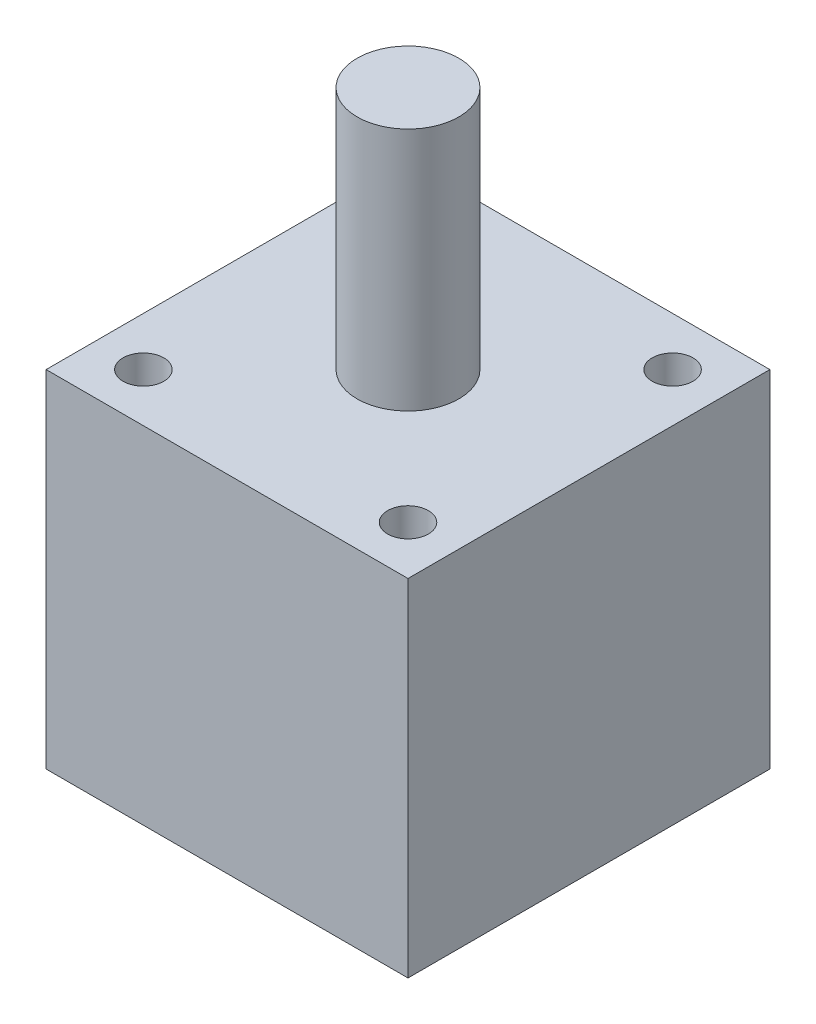
ISO-10303-21;
HEADER;
FILE_DESCRIPTION(('STEP AP214'),'2;1');
FILE_NAME('part.step','',(''),(''),'','','');
FILE_SCHEMA(('AUTOMOTIVE_DESIGN { 1 0 10303 214 1 1 1 1 }'));
ENDSEC;
DATA;
#1=APPLICATION_CONTEXT('core data for automotive mechanical design processes');
#2=APPLICATION_PROTOCOL_DEFINITION('international standard','automotive_design',2000,#1);
#3=PRODUCT_CONTEXT('',#1,'mechanical');
#4=PRODUCT('Part','Part','',(#3));
#5=PRODUCT_RELATED_PRODUCT_CATEGORY('part','',(#4));
#6=PRODUCT_DEFINITION_FORMATION('','',#4);
#7=PRODUCT_DEFINITION_CONTEXT('part definition',#1,'design');
#8=PRODUCT_DEFINITION('design','',#6,#7);
#9=PRODUCT_DEFINITION_SHAPE('','',#8);
#10=(LENGTH_UNIT() NAMED_UNIT(*) SI_UNIT(.MILLI.,.METRE.));
#11=(NAMED_UNIT(*) PLANE_ANGLE_UNIT() SI_UNIT($,.RADIAN.));
#12=(NAMED_UNIT(*) SI_UNIT($,.STERADIAN.) SOLID_ANGLE_UNIT());
#13=UNCERTAINTY_MEASURE_WITH_UNIT(LENGTH_MEASURE(1.E-05),#10,'distance_accuracy_value','');
#14=(GEOMETRIC_REPRESENTATION_CONTEXT(3) GLOBAL_UNCERTAINTY_ASSIGNED_CONTEXT((#13)) GLOBAL_UNIT_ASSIGNED_CONTEXT((#10,
#11,#12)) REPRESENTATION_CONTEXT('',''));
#15=CARTESIAN_POINT('',(0.,0.,0.));
#16=DIRECTION('',(0.,0.,1.));
#17=DIRECTION('',(1.,0.,0.));
#18=AXIS2_PLACEMENT_3D('',#15,#16,#17);
#19=CARTESIAN_POINT('',(17.78,34.,17.78));
#20=DIRECTION('',(-1.,0.,0.));
#21=DIRECTION('',(0.,0.,1.));
#22=AXIS2_PLACEMENT_3D('',#19,#20,#21);
#23=PLANE('',#22);
#24=DIRECTION('',(0.,0.,-1.));
#25=VECTOR('',#24,1.);
#26=CARTESIAN_POINT('',(17.78,0.,17.78));
#27=LINE('',#26,#25);
#28=CARTESIAN_POINT('',(17.78,0.,17.78));
#29=VERTEX_POINT('',#28);
#30=CARTESIAN_POINT('',(17.78,0.,-17.78));
#31=VERTEX_POINT('',#30);
#32=EDGE_CURVE('E113',#29,#31,#27,.T.);
#33=ORIENTED_EDGE('',*,*,#32,.T.);
#34=DIRECTION('',(0.,-1.,0.));
#35=VECTOR('',#34,1.);
#36=CARTESIAN_POINT('',(17.78,34.,-17.78));
#37=LINE('',#36,#35);
#38=CARTESIAN_POINT('',(17.78,34.,-17.78));
#39=VERTEX_POINT('',#38);
#40=EDGE_CURVE('E44',#39,#31,#37,.T.);
#41=ORIENTED_EDGE('',*,*,#40,.F.);
#42=DIRECTION('',(0.,0.,-1.));
#43=VECTOR('',#42,1.);
#44=CARTESIAN_POINT('',(17.78,34.,17.78));
#45=LINE('',#44,#43);
#46=CARTESIAN_POINT('',(17.78,34.,17.78));
#47=VERTEX_POINT('',#46);
#48=EDGE_CURVE('E96',#47,#39,#45,.T.);
#49=ORIENTED_EDGE('',*,*,#48,.F.);
#50=DIRECTION('',(0.,-1.,0.));
#51=VECTOR('',#50,1.);
#52=CARTESIAN_POINT('',(17.78,34.,17.78));
#53=LINE('',#52,#51);
#54=EDGE_CURVE('E109',#47,#29,#53,.T.);
#55=ORIENTED_EDGE('',*,*,#54,.T.);
#56=EDGE_LOOP('',(#33,#41,#49,#55));
#57=FACE_BOUND('',#56,.T.);
#58=ADVANCED_FACE('F41',(#57),#23,.F.);
#59=CARTESIAN_POINT('',(-17.78,34.,-17.78));
#60=DIRECTION('',(0.,0.,1.));
#61=DIRECTION('',(1.,0.,0.));
#62=AXIS2_PLACEMENT_3D('',#59,#60,#61);
#63=PLANE('',#62);
#64=DIRECTION('',(-1.,0.,0.));
#65=VECTOR('',#64,1.);
#66=CARTESIAN_POINT('',(-17.78,0.,-17.78));
#67=LINE('',#66,#65);
#68=CARTESIAN_POINT('',(-17.78,0.,-17.78));
#69=VERTEX_POINT('',#68);
#70=EDGE_CURVE('E102',#31,#69,#67,.T.);
#71=ORIENTED_EDGE('',*,*,#70,.T.);
#72=DIRECTION('',(0.,-1.,0.));
#73=VECTOR('',#72,1.);
#74=CARTESIAN_POINT('',(-17.78,34.,-17.78));
#75=LINE('',#74,#73);
#76=CARTESIAN_POINT('',(-17.78,34.,-17.78));
#77=VERTEX_POINT('',#76);
#78=EDGE_CURVE('E100',#77,#69,#75,.T.);
#79=ORIENTED_EDGE('',*,*,#78,.F.);
#80=DIRECTION('',(-1.,0.,0.));
#81=VECTOR('',#80,1.);
#82=CARTESIAN_POINT('',(-17.78,34.,-17.78));
#83=LINE('',#82,#81);
#84=EDGE_CURVE('E91',#39,#77,#83,.T.);
#85=ORIENTED_EDGE('',*,*,#84,.F.);
#86=ORIENTED_EDGE('',*,*,#40,.T.);
#87=EDGE_LOOP('',(#71,#79,#85,#86));
#88=FACE_BOUND('',#87,.T.);
#89=ADVANCED_FACE('F101',(#88),#63,.F.);
#90=CARTESIAN_POINT('',(-17.78,34.,17.78));
#91=DIRECTION('',(1.,0.,0.));
#92=DIRECTION('',(0.,0.,-1.));
#93=AXIS2_PLACEMENT_3D('',#90,#91,#92);
#94=PLANE('',#93);
#95=DIRECTION('',(0.,0.,1.));
#96=VECTOR('',#95,1.);
#97=CARTESIAN_POINT('',(-17.78,0.,17.78));
#98=LINE('',#97,#96);
#99=CARTESIAN_POINT('',(-17.78,0.,17.78));
#100=VERTEX_POINT('',#99);
#101=EDGE_CURVE('E77',#69,#100,#98,.T.);
#102=ORIENTED_EDGE('',*,*,#101,.T.);
#103=DIRECTION('',(0.,-1.,0.));
#104=VECTOR('',#103,1.);
#105=CARTESIAN_POINT('',(-17.78,34.,17.78));
#106=LINE('',#105,#104);
#107=CARTESIAN_POINT('',(-17.78,34.,17.78));
#108=VERTEX_POINT('',#107);
#109=EDGE_CURVE('E104',#108,#100,#106,.T.);
#110=ORIENTED_EDGE('',*,*,#109,.F.);
#111=DIRECTION('',(0.,0.,1.));
#112=VECTOR('',#111,1.);
#113=CARTESIAN_POINT('',(-17.78,34.,17.78));
#114=LINE('',#113,#112);
#115=EDGE_CURVE('E94',#77,#108,#114,.T.);
#116=ORIENTED_EDGE('',*,*,#115,.F.);
#117=ORIENTED_EDGE('',*,*,#78,.T.);
#118=EDGE_LOOP('',(#102,#110,#116,#117));
#119=FACE_BOUND('',#118,.T.);
#120=ADVANCED_FACE('F105',(#119),#94,.F.);
#121=CARTESIAN_POINT('',(-17.78,34.,17.78));
#122=DIRECTION('',(0.,0.,-1.));
#123=DIRECTION('',(-1.,0.,0.));
#124=AXIS2_PLACEMENT_3D('',#121,#122,#123);
#125=PLANE('',#124);
#126=DIRECTION('',(1.,0.,0.));
#127=VECTOR('',#126,1.);
#128=CARTESIAN_POINT('',(-17.78,0.,17.78));
#129=LINE('',#128,#127);
#130=EDGE_CURVE('E83',#100,#29,#129,.T.);
#131=ORIENTED_EDGE('',*,*,#130,.T.);
#132=ORIENTED_EDGE('',*,*,#54,.F.);
#133=DIRECTION('',(1.,0.,0.));
#134=VECTOR('',#133,1.);
#135=CARTESIAN_POINT('',(-17.78,34.,17.78));
#136=LINE('',#135,#134);
#137=EDGE_CURVE('E60',#108,#47,#136,.T.);
#138=ORIENTED_EDGE('',*,*,#137,.F.);
#139=ORIENTED_EDGE('',*,*,#109,.T.);
#140=EDGE_LOOP('',(#131,#132,#138,#139));
#141=FACE_BOUND('',#140,.T.);
#142=ADVANCED_FACE('F127',(#141),#125,.F.);
#143=CARTESIAN_POINT('',(0.,34.,0.));
#144=DIRECTION('',(0.,-1.,0.));
#145=DIRECTION('',(0.,0.,-1.));
#146=AXIS2_PLACEMENT_3D('',#143,#144,#145);
#147=PLANE('',#146);
#148=CARTESIAN_POINT('',(-13.,34.,13.));
#149=DIRECTION('',(0.,1.,0.));
#150=DIRECTION('',(0.,0.,1.));
#151=AXIS2_PLACEMENT_3D('',#148,#149,#150);
#152=CIRCLE('',#151,2.);
#153=CARTESIAN_POINT('',(-13.,34.,15.));
#154=VERTEX_POINT('',#153);
#155=EDGE_CURVE('E158',#154,#154,#152,.T.);
#156=ORIENTED_EDGE('',*,*,#155,.F.);
#157=EDGE_LOOP('',(#156));
#158=FACE_BOUND('',#157,.T.);
#159=CARTESIAN_POINT('',(13.,34.,13.));
#160=DIRECTION('',(0.,1.,0.));
#161=DIRECTION('',(0.,0.,1.));
#162=AXIS2_PLACEMENT_3D('',#159,#160,#161);
#163=CIRCLE('',#162,2.);
#164=CARTESIAN_POINT('',(13.,34.,15.));
#165=VERTEX_POINT('',#164);
#166=EDGE_CURVE('E157',#165,#165,#163,.T.);
#167=ORIENTED_EDGE('',*,*,#166,.F.);
#168=EDGE_LOOP('',(#167));
#169=FACE_BOUND('',#168,.T.);
#170=CARTESIAN_POINT('',(13.,34.,-13.));
#171=DIRECTION('',(0.,1.,0.));
#172=DIRECTION('',(0.,0.,1.));
#173=AXIS2_PLACEMENT_3D('',#170,#171,#172);
#174=CIRCLE('',#173,2.);
#175=CARTESIAN_POINT('',(13.,34.,-11.));
#176=VERTEX_POINT('',#175);
#177=EDGE_CURVE('E166',#176,#176,#174,.T.);
#178=ORIENTED_EDGE('',*,*,#177,.F.);
#179=EDGE_LOOP('',(#178));
#180=FACE_BOUND('',#179,.T.);
#181=CARTESIAN_POINT('',(-13.,34.,-13.));
#182=DIRECTION('',(0.,1.,0.));
#183=DIRECTION('',(0.,0.,1.));
#184=AXIS2_PLACEMENT_3D('',#181,#182,#183);
#185=CIRCLE('',#184,2.);
#186=CARTESIAN_POINT('',(-13.,34.,-11.));
#187=VERTEX_POINT('',#186);
#188=EDGE_CURVE('E148',#187,#187,#185,.T.);
#189=ORIENTED_EDGE('',*,*,#188,.F.);
#190=EDGE_LOOP('',(#189));
#191=FACE_BOUND('',#190,.T.);
#192=CARTESIAN_POINT('',(0.,34.,0.));
#193=DIRECTION('',(0.,1.,0.));
#194=DIRECTION('',(0.,0.,1.));
#195=AXIS2_PLACEMENT_3D('',#192,#193,#194);
#196=CIRCLE('',#195,5.);
#197=CARTESIAN_POINT('',(0.,34.,5.));
#198=VERTEX_POINT('',#197);
#199=EDGE_CURVE('E51',#198,#198,#196,.T.);
#200=ORIENTED_EDGE('',*,*,#199,.F.);
#201=EDGE_LOOP('',(#200));
#202=FACE_BOUND('',#201,.T.);
#203=ORIENTED_EDGE('',*,*,#48,.T.);
#204=ORIENTED_EDGE('',*,*,#84,.T.);
#205=ORIENTED_EDGE('',*,*,#115,.T.);
#206=ORIENTED_EDGE('',*,*,#137,.T.);
#207=EDGE_LOOP('',(#203,#204,#205,#206));
#208=FACE_BOUND('',#207,.T.);
#209=ADVANCED_FACE('F92',(#158,#169,#180,#191,#202,#208),#147,.F.);
#210=CARTESIAN_POINT('',(0.,0.,0.));
#211=DIRECTION('',(0.,-1.,0.));
#212=DIRECTION('',(0.,0.,-1.));
#213=AXIS2_PLACEMENT_3D('',#210,#211,#212);
#214=PLANE('',#213);
#215=CARTESIAN_POINT('',(-13.,0.,13.));
#216=DIRECTION('',(0.,-1.,0.));
#217=DIRECTION('',(0.,0.,-1.));
#218=AXIS2_PLACEMENT_3D('',#215,#216,#217);
#219=CIRCLE('',#218,2.);
#220=CARTESIAN_POINT('',(-13.,0.,11.));
#221=VERTEX_POINT('',#220);
#222=EDGE_CURVE('E153',#221,#221,#219,.F.);
#223=ORIENTED_EDGE('',*,*,#222,.T.);
#224=EDGE_LOOP('',(#223));
#225=FACE_BOUND('',#224,.T.);
#226=CARTESIAN_POINT('',(13.,0.,13.));
#227=DIRECTION('',(0.,-1.,0.));
#228=DIRECTION('',(0.,0.,-1.));
#229=AXIS2_PLACEMENT_3D('',#226,#227,#228);
#230=CIRCLE('',#229,2.);
#231=CARTESIAN_POINT('',(13.,0.,11.));
#232=VERTEX_POINT('',#231);
#233=EDGE_CURVE('E162',#232,#232,#230,.F.);
#234=ORIENTED_EDGE('',*,*,#233,.T.);
#235=EDGE_LOOP('',(#234));
#236=FACE_BOUND('',#235,.T.);
#237=CARTESIAN_POINT('',(13.,0.,-13.));
#238=DIRECTION('',(0.,-1.,0.));
#239=DIRECTION('',(0.,0.,-1.));
#240=AXIS2_PLACEMENT_3D('',#237,#238,#239);
#241=CIRCLE('',#240,2.);
#242=CARTESIAN_POINT('',(13.,0.,-15.));
#243=VERTEX_POINT('',#242);
#244=EDGE_CURVE('E152',#243,#243,#241,.F.);
#245=ORIENTED_EDGE('',*,*,#244,.T.);
#246=EDGE_LOOP('',(#245));
#247=FACE_BOUND('',#246,.T.);
#248=CARTESIAN_POINT('',(-13.,0.,-13.));
#249=DIRECTION('',(0.,-1.,0.));
#250=DIRECTION('',(0.,0.,-1.));
#251=AXIS2_PLACEMENT_3D('',#248,#249,#250);
#252=CIRCLE('',#251,2.);
#253=CARTESIAN_POINT('',(-13.,0.,-15.));
#254=VERTEX_POINT('',#253);
#255=EDGE_CURVE('E144',#254,#254,#252,.F.);
#256=ORIENTED_EDGE('',*,*,#255,.T.);
#257=EDGE_LOOP('',(#256));
#258=FACE_BOUND('',#257,.T.);
#259=CARTESIAN_POINT('',(0.,0.,0.));
#260=DIRECTION('',(0.,-1.,0.));
#261=DIRECTION('',(0.,0.,-1.));
#262=AXIS2_PLACEMENT_3D('',#259,#260,#261);
#263=CIRCLE('',#262,5.);
#264=CARTESIAN_POINT('',(0.,0.,-5.));
#265=VERTEX_POINT('',#264);
#266=EDGE_CURVE('E11',#265,#265,#263,.T.);
#267=ORIENTED_EDGE('',*,*,#266,.F.);
#268=EDGE_LOOP('',(#267));
#269=FACE_BOUND('',#268,.T.);
#270=ORIENTED_EDGE('',*,*,#32,.F.);
#271=ORIENTED_EDGE('',*,*,#130,.F.);
#272=ORIENTED_EDGE('',*,*,#101,.F.);
#273=ORIENTED_EDGE('',*,*,#70,.F.);
#274=EDGE_LOOP('',(#270,#271,#272,#273));
#275=FACE_BOUND('',#274,.T.);
#276=ADVANCED_FACE('F130',(#225,#236,#247,#258,#269,#275),#214,.T.);
#277=CARTESIAN_POINT('',(0.,58.,0.));
#278=DIRECTION('',(0.,-1.,0.));
#279=DIRECTION('',(0.,0.,-1.));
#280=AXIS2_PLACEMENT_3D('',#277,#278,#279);
#281=CYLINDRICAL_SURFACE('',#280,5.);
#282=CARTESIAN_POINT('',(0.,58.,0.));
#283=DIRECTION('',(0.,1.,0.));
#284=DIRECTION('',(0.,0.,1.));
#285=AXIS2_PLACEMENT_3D('',#282,#283,#284);
#286=CIRCLE('',#285,5.);
#287=CARTESIAN_POINT('',(0.,58.,5.));
#288=VERTEX_POINT('',#287);
#289=EDGE_CURVE('E117',#288,#288,#286,.T.);
#290=ORIENTED_EDGE('',*,*,#289,.F.);
#291=EDGE_LOOP('',(#290));
#292=FACE_BOUND('',#291,.T.);
#293=ORIENTED_EDGE('',*,*,#199,.T.);
#294=EDGE_LOOP('',(#293));
#295=FACE_BOUND('',#294,.T.);
#296=ADVANCED_FACE('F188',(#292,#295),#281,.T.);
#297=CARTESIAN_POINT('',(0.,58.,0.));
#298=DIRECTION('',(0.,1.,0.));
#299=DIRECTION('',(0.,0.,1.));
#300=AXIS2_PLACEMENT_3D('',#297,#298,#299);
#301=PLANE('',#300);
#302=ORIENTED_EDGE('',*,*,#289,.T.);
#303=EDGE_LOOP('',(#302));
#304=FACE_BOUND('',#303,.T.);
#305=ADVANCED_FACE('F190',(#304),#301,.T.);
#306=CARTESIAN_POINT('',(0.,-12.,0.));
#307=DIRECTION('',(0.,1.,0.));
#308=DIRECTION('',(0.,0.,1.));
#309=AXIS2_PLACEMENT_3D('',#306,#307,#308);
#310=CYLINDRICAL_SURFACE('',#309,5.);
#311=CARTESIAN_POINT('',(0.,-12.,0.));
#312=DIRECTION('',(0.,-1.,0.));
#313=DIRECTION('',(0.,0.,-1.));
#314=AXIS2_PLACEMENT_3D('',#311,#312,#313);
#315=CIRCLE('',#314,5.);
#316=CARTESIAN_POINT('',(0.,-12.,-5.));
#317=VERTEX_POINT('',#316);
#318=EDGE_CURVE('E139',#317,#317,#315,.T.);
#319=ORIENTED_EDGE('',*,*,#318,.F.);
#320=EDGE_LOOP('',(#319));
#321=FACE_BOUND('',#320,.T.);
#322=ORIENTED_EDGE('',*,*,#266,.T.);
#323=EDGE_LOOP('',(#322));
#324=FACE_BOUND('',#323,.T.);
#325=ADVANCED_FACE('F197',(#321,#324),#310,.T.);
#326=CARTESIAN_POINT('',(0.,-12.,0.));
#327=DIRECTION('',(0.,-1.,0.));
#328=DIRECTION('',(0.,0.,-1.));
#329=AXIS2_PLACEMENT_3D('',#326,#327,#328);
#330=PLANE('',#329);
#331=ORIENTED_EDGE('',*,*,#318,.T.);
#332=EDGE_LOOP('',(#331));
#333=FACE_BOUND('',#332,.T.);
#334=ADVANCED_FACE('F237',(#333),#330,.T.);
#335=CARTESIAN_POINT('',(-13.,-5.65685424949237,-13.));
#336=DIRECTION('',(0.,1.,0.));
#337=DIRECTION('',(0.,0.,1.));
#338=AXIS2_PLACEMENT_3D('',#335,#336,#337);
#339=CYLINDRICAL_SURFACE('',#338,2.);
#340=ORIENTED_EDGE('',*,*,#188,.T.);
#341=EDGE_LOOP('',(#340));
#342=FACE_BOUND('',#341,.T.);
#343=ORIENTED_EDGE('',*,*,#255,.F.);
#344=EDGE_LOOP('',(#343));
#345=FACE_BOUND('',#344,.T.);
#346=ADVANCED_FACE('F232',(#342,#345),#339,.F.);
#347=CARTESIAN_POINT('',(13.,-5.65685424949237,-13.));
#348=DIRECTION('',(0.,1.,0.));
#349=DIRECTION('',(0.,0.,1.));
#350=AXIS2_PLACEMENT_3D('',#347,#348,#349);
#351=CYLINDRICAL_SURFACE('',#350,2.);
#352=ORIENTED_EDGE('',*,*,#177,.T.);
#353=EDGE_LOOP('',(#352));
#354=FACE_BOUND('',#353,.T.);
#355=ORIENTED_EDGE('',*,*,#244,.F.);
#356=EDGE_LOOP('',(#355));
#357=FACE_BOUND('',#356,.T.);
#358=ADVANCED_FACE('F177',(#354,#357),#351,.F.);
#359=CARTESIAN_POINT('',(13.,-5.65685424949237,13.));
#360=DIRECTION('',(0.,1.,0.));
#361=DIRECTION('',(0.,0.,1.));
#362=AXIS2_PLACEMENT_3D('',#359,#360,#361);
#363=CYLINDRICAL_SURFACE('',#362,2.);
#364=ORIENTED_EDGE('',*,*,#166,.T.);
#365=EDGE_LOOP('',(#364));
#366=FACE_BOUND('',#365,.T.);
#367=ORIENTED_EDGE('',*,*,#233,.F.);
#368=EDGE_LOOP('',(#367));
#369=FACE_BOUND('',#368,.T.);
#370=ADVANCED_FACE('F249',(#366,#369),#363,.F.);
#371=CARTESIAN_POINT('',(-13.,-5.65685424949237,13.));
#372=DIRECTION('',(0.,1.,0.));
#373=DIRECTION('',(0.,0.,1.));
#374=AXIS2_PLACEMENT_3D('',#371,#372,#373);
#375=CYLINDRICAL_SURFACE('',#374,2.);
#376=ORIENTED_EDGE('',*,*,#155,.T.);
#377=EDGE_LOOP('',(#376));
#378=FACE_BOUND('',#377,.T.);
#379=ORIENTED_EDGE('',*,*,#222,.F.);
#380=EDGE_LOOP('',(#379));
#381=FACE_BOUND('',#380,.T.);
#382=ADVANCED_FACE('F258',(#378,#381),#375,.F.);
#383=CLOSED_SHELL('',(#58,#89,#120,#142,#209,#276,#296,#305,#325,#334,#346,#358,#370,#382));
#384=MANIFOLD_SOLID_BREP('B2',#383);
#385=ADVANCED_BREP_SHAPE_REPRESENTATION('',(#18,#384),#14);
#386=SHAPE_DEFINITION_REPRESENTATION(#9,#385);
ENDSEC;
END-ISO-10303-21;
